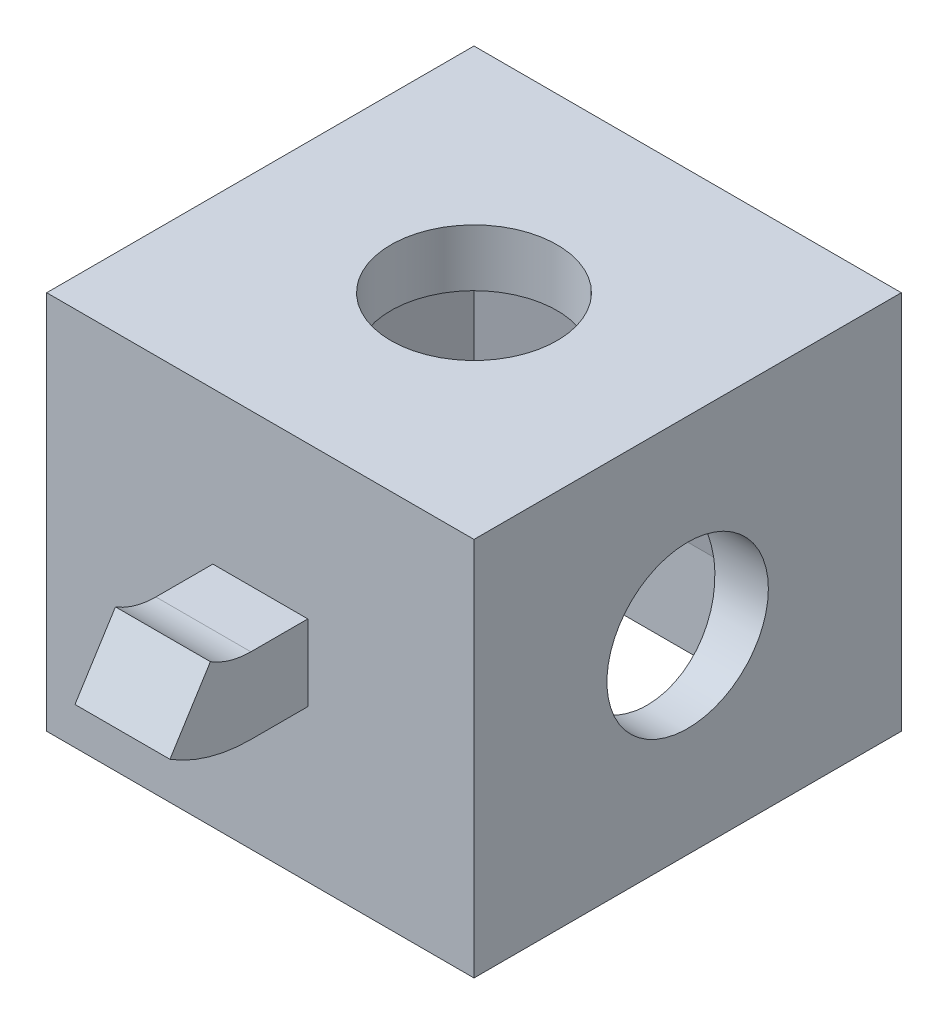
ISO-10303-21;
HEADER;
FILE_DESCRIPTION(('STEP AP214'),'2;1');
FILE_NAME('part.step','',(''),(''),'','','');
FILE_SCHEMA(('AUTOMOTIVE_DESIGN { 1 0 10303 214 1 1 1 1 }'));
ENDSEC;
DATA;
#1=APPLICATION_CONTEXT('core data for automotive mechanical design processes');
#2=APPLICATION_PROTOCOL_DEFINITION('international standard','automotive_design',2000,#1);
#3=PRODUCT_CONTEXT('',#1,'mechanical');
#4=PRODUCT('Part','Part','',(#3));
#5=PRODUCT_RELATED_PRODUCT_CATEGORY('part','',(#4));
#6=PRODUCT_DEFINITION_FORMATION('','',#4);
#7=PRODUCT_DEFINITION_CONTEXT('part definition',#1,'design');
#8=PRODUCT_DEFINITION('design','',#6,#7);
#9=PRODUCT_DEFINITION_SHAPE('','',#8);
#10=(LENGTH_UNIT() NAMED_UNIT(*) SI_UNIT(.MILLI.,.METRE.));
#11=(NAMED_UNIT(*) PLANE_ANGLE_UNIT() SI_UNIT($,.RADIAN.));
#12=(NAMED_UNIT(*) SI_UNIT($,.STERADIAN.) SOLID_ANGLE_UNIT());
#13=UNCERTAINTY_MEASURE_WITH_UNIT(LENGTH_MEASURE(1.E-05),#10,'distance_accuracy_value','');
#14=(GEOMETRIC_REPRESENTATION_CONTEXT(3) GLOBAL_UNCERTAINTY_ASSIGNED_CONTEXT((#13)) GLOBAL_UNIT_ASSIGNED_CONTEXT((#10,
#11,#12)) REPRESENTATION_CONTEXT('',''));
#15=CARTESIAN_POINT('',(0.,0.,0.));
#16=DIRECTION('',(0.,0.,1.));
#17=DIRECTION('',(1.,0.,0.));
#18=AXIS2_PLACEMENT_3D('',#15,#16,#17);
#19=CARTESIAN_POINT('',(11.25,20.,-11.25));
#20=DIRECTION('',(0.,0.,1.));
#21=DIRECTION('',(1.,0.,0.));
#22=AXIS2_PLACEMENT_3D('',#19,#20,#21);
#23=PLANE('',#22);
#24=DIRECTION('',(-1.,0.,0.));
#25=VECTOR('',#24,1.);
#26=CARTESIAN_POINT('',(11.25,0.,-11.25));
#27=LINE('',#26,#25);
#28=CARTESIAN_POINT('',(11.25,0.,-11.25));
#29=VERTEX_POINT('',#28);
#30=CARTESIAN_POINT('',(-11.25,0.,-11.25));
#31=VERTEX_POINT('',#30);
#32=EDGE_CURVE('E360',#29,#31,#27,.T.);
#33=ORIENTED_EDGE('',*,*,#32,.T.);
#34=DIRECTION('',(0.,-1.,0.));
#35=VECTOR('',#34,1.);
#36=CARTESIAN_POINT('',(-11.25,20.,-11.25));
#37=LINE('',#36,#35);
#38=CARTESIAN_POINT('',(-11.25,20.,-11.25));
#39=VERTEX_POINT('',#38);
#40=EDGE_CURVE('E366',#39,#31,#37,.T.);
#41=ORIENTED_EDGE('',*,*,#40,.F.);
#42=DIRECTION('',(-1.,0.,0.));
#43=VECTOR('',#42,1.);
#44=CARTESIAN_POINT('',(11.25,20.,-11.25));
#45=LINE('',#44,#43);
#46=CARTESIAN_POINT('',(11.25,20.,-11.25));
#47=VERTEX_POINT('',#46);
#48=EDGE_CURVE('E364',#47,#39,#45,.T.);
#49=ORIENTED_EDGE('',*,*,#48,.F.);
#50=DIRECTION('',(0.,-1.,0.));
#51=VECTOR('',#50,1.);
#52=CARTESIAN_POINT('',(11.25,20.,-11.25));
#53=LINE('',#52,#51);
#54=EDGE_CURVE('E376',#47,#29,#53,.T.);
#55=ORIENTED_EDGE('',*,*,#54,.T.);
#56=EDGE_LOOP('',(#33,#41,#49,#55));
#57=FACE_BOUND('',#56,.T.);
#58=DIRECTION('',(0.,-1.,0.));
#59=VECTOR('',#58,1.);
#60=CARTESIAN_POINT('',(2.5,12.,-11.25));
#61=LINE('',#60,#59);
#62=CARTESIAN_POINT('',(2.5,12.,-11.25));
#63=VERTEX_POINT('',#62);
#64=CARTESIAN_POINT('',(2.5,8.,-11.25));
#65=VERTEX_POINT('',#64);
#66=EDGE_CURVE('E194',#63,#65,#61,.T.);
#67=ORIENTED_EDGE('',*,*,#66,.F.);
#68=DIRECTION('',(1.,0.,0.));
#69=VECTOR('',#68,1.);
#70=CARTESIAN_POINT('',(-2.5,12.,-11.25));
#71=LINE('',#70,#69);
#72=CARTESIAN_POINT('',(-2.5,12.,-11.25));
#73=VERTEX_POINT('',#72);
#74=EDGE_CURVE('E243',#73,#63,#71,.T.);
#75=ORIENTED_EDGE('',*,*,#74,.F.);
#76=DIRECTION('',(0.,1.,0.));
#77=VECTOR('',#76,1.);
#78=CARTESIAN_POINT('',(-2.5,12.,-11.25));
#79=LINE('',#78,#77);
#80=CARTESIAN_POINT('',(-2.5,8.,-11.25));
#81=VERTEX_POINT('',#80);
#82=EDGE_CURVE('E250',#81,#73,#79,.T.);
#83=ORIENTED_EDGE('',*,*,#82,.F.);
#84=DIRECTION('',(-1.,0.,0.));
#85=VECTOR('',#84,1.);
#86=CARTESIAN_POINT('',(-2.5,8.,-11.25));
#87=LINE('',#86,#85);
#88=EDGE_CURVE('E56',#65,#81,#87,.T.);
#89=ORIENTED_EDGE('',*,*,#88,.F.);
#90=EDGE_LOOP('',(#67,#75,#83,#89));
#91=FACE_BOUND('',#90,.T.);
#92=ADVANCED_FACE('F33',(#57,#91),#23,.F.);
#93=CARTESIAN_POINT('',(0.,0.,0.));
#94=DIRECTION('',(0.,1.,0.));
#95=DIRECTION('',(0.,0.,1.));
#96=AXIS2_PLACEMENT_3D('',#93,#94,#95);
#97=PLANE('',#96);
#98=DIRECTION('',(0.,0.,1.));
#99=VECTOR('',#98,1.);
#100=CARTESIAN_POINT('',(-11.25,0.,11.25));
#101=LINE('',#100,#99);
#102=CARTESIAN_POINT('',(-11.25,0.,11.25));
#103=VERTEX_POINT('',#102);
#104=EDGE_CURVE('E355',#31,#103,#101,.T.);
#105=ORIENTED_EDGE('',*,*,#104,.F.);
#106=ORIENTED_EDGE('',*,*,#32,.F.);
#107=DIRECTION('',(0.,0.,-1.));
#108=VECTOR('',#107,1.);
#109=CARTESIAN_POINT('',(11.25,0.,11.25));
#110=LINE('',#109,#108);
#111=CARTESIAN_POINT('',(11.25,0.,11.25));
#112=VERTEX_POINT('',#111);
#113=EDGE_CURVE('E371',#112,#29,#110,.T.);
#114=ORIENTED_EDGE('',*,*,#113,.F.);
#115=DIRECTION('',(1.,0.,0.));
#116=VECTOR('',#115,1.);
#117=CARTESIAN_POINT('',(11.25,0.,11.25));
#118=LINE('',#117,#116);
#119=EDGE_CURVE('E369',#103,#112,#118,.T.);
#120=ORIENTED_EDGE('',*,*,#119,.F.);
#121=EDGE_LOOP('',(#105,#106,#114,#120));
#122=FACE_BOUND('',#121,.T.);
#123=DIRECTION('',(0.,0.,1.));
#124=VECTOR('',#123,1.);
#125=CARTESIAN_POINT('',(9.25,0.,-9.25));
#126=LINE('',#125,#124);
#127=CARTESIAN_POINT('',(9.25,0.,-9.25));
#128=VERTEX_POINT('',#127);
#129=CARTESIAN_POINT('',(9.25,0.,9.25));
#130=VERTEX_POINT('',#129);
#131=EDGE_CURVE('E323',#128,#130,#126,.T.);
#132=ORIENTED_EDGE('',*,*,#131,.F.);
#133=DIRECTION('',(1.,0.,0.));
#134=VECTOR('',#133,1.);
#135=CARTESIAN_POINT('',(-9.25,0.,-9.25));
#136=LINE('',#135,#134);
#137=CARTESIAN_POINT('',(-9.25,0.,-9.25));
#138=VERTEX_POINT('',#137);
#139=EDGE_CURVE('E331',#138,#128,#136,.T.);
#140=ORIENTED_EDGE('',*,*,#139,.F.);
#141=DIRECTION('',(0.,0.,-1.));
#142=VECTOR('',#141,1.);
#143=CARTESIAN_POINT('',(-9.25,0.,-9.25));
#144=LINE('',#143,#142);
#145=CARTESIAN_POINT('',(-9.25,0.,9.25));
#146=VERTEX_POINT('',#145);
#147=EDGE_CURVE('E328',#146,#138,#144,.T.);
#148=ORIENTED_EDGE('',*,*,#147,.F.);
#149=DIRECTION('',(-1.,0.,0.));
#150=VECTOR('',#149,1.);
#151=CARTESIAN_POINT('',(-9.25,0.,9.25));
#152=LINE('',#151,#150);
#153=EDGE_CURVE('E325',#130,#146,#152,.T.);
#154=ORIENTED_EDGE('',*,*,#153,.F.);
#155=EDGE_LOOP('',(#132,#140,#148,#154));
#156=FACE_BOUND('',#155,.T.);
#157=ADVANCED_FACE('F389',(#122,#156),#97,.F.);
#158=CARTESIAN_POINT('',(-11.25,20.,11.25));
#159=DIRECTION('',(1.,0.,0.));
#160=DIRECTION('',(0.,0.,-1.));
#161=AXIS2_PLACEMENT_3D('',#158,#159,#160);
#162=PLANE('',#161);
#163=ORIENTED_EDGE('',*,*,#104,.T.);
#164=DIRECTION('',(0.,-1.,0.));
#165=VECTOR('',#164,1.);
#166=CARTESIAN_POINT('',(-11.25,20.,11.25));
#167=LINE('',#166,#165);
#168=CARTESIAN_POINT('',(-11.25,20.,11.25));
#169=VERTEX_POINT('',#168);
#170=EDGE_CURVE('E11',#169,#103,#167,.T.);
#171=ORIENTED_EDGE('',*,*,#170,.F.);
#172=DIRECTION('',(0.,0.,1.));
#173=VECTOR('',#172,1.);
#174=CARTESIAN_POINT('',(-11.25,20.,11.25));
#175=LINE('',#174,#173);
#176=EDGE_CURVE('E356',#39,#169,#175,.T.);
#177=ORIENTED_EDGE('',*,*,#176,.F.);
#178=ORIENTED_EDGE('',*,*,#40,.T.);
#179=EDGE_LOOP('',(#163,#171,#177,#178));
#180=FACE_BOUND('',#179,.T.);
#181=ADVANCED_FACE('F35',(#180),#162,.F.);
#182=CARTESIAN_POINT('',(11.25,20.,11.25));
#183=DIRECTION('',(0.,0.,-1.));
#184=DIRECTION('',(-1.,0.,0.));
#185=AXIS2_PLACEMENT_3D('',#182,#183,#184);
#186=PLANE('',#185);
#187=DIRECTION('',(1.,0.,0.));
#188=VECTOR('',#187,1.);
#189=CARTESIAN_POINT('',(-2.5,12.,11.25));
#190=LINE('',#189,#188);
#191=CARTESIAN_POINT('',(-2.5,12.,11.25));
#192=VERTEX_POINT('',#191);
#193=CARTESIAN_POINT('',(2.5,12.,11.25));
#194=VERTEX_POINT('',#193);
#195=EDGE_CURVE('E219',#192,#194,#190,.T.);
#196=ORIENTED_EDGE('',*,*,#195,.T.);
#197=DIRECTION('',(0.,-1.,0.));
#198=VECTOR('',#197,1.);
#199=CARTESIAN_POINT('',(2.5,12.,11.25));
#200=LINE('',#199,#198);
#201=CARTESIAN_POINT('',(2.5,8.,11.25));
#202=VERTEX_POINT('',#201);
#203=EDGE_CURVE('E201',#194,#202,#200,.T.);
#204=ORIENTED_EDGE('',*,*,#203,.T.);
#205=DIRECTION('',(-1.,0.,0.));
#206=VECTOR('',#205,1.);
#207=CARTESIAN_POINT('',(-2.5,8.,11.25));
#208=LINE('',#207,#206);
#209=CARTESIAN_POINT('',(-2.5,8.,11.25));
#210=VERTEX_POINT('',#209);
#211=EDGE_CURVE('E210',#202,#210,#208,.T.);
#212=ORIENTED_EDGE('',*,*,#211,.T.);
#213=DIRECTION('',(0.,1.,0.));
#214=VECTOR('',#213,1.);
#215=CARTESIAN_POINT('',(-2.5,12.,11.25));
#216=LINE('',#215,#214);
#217=EDGE_CURVE('E48',#210,#192,#216,.T.);
#218=ORIENTED_EDGE('',*,*,#217,.T.);
#219=EDGE_LOOP('',(#196,#204,#212,#218));
#220=FACE_BOUND('',#219,.T.);
#221=ORIENTED_EDGE('',*,*,#119,.T.);
#222=DIRECTION('',(0.,-1.,0.));
#223=VECTOR('',#222,1.);
#224=CARTESIAN_POINT('',(11.25,20.,11.25));
#225=LINE('',#224,#223);
#226=CARTESIAN_POINT('',(11.25,20.,11.25));
#227=VERTEX_POINT('',#226);
#228=EDGE_CURVE('E41',#227,#112,#225,.T.);
#229=ORIENTED_EDGE('',*,*,#228,.F.);
#230=DIRECTION('',(1.,0.,0.));
#231=VECTOR('',#230,1.);
#232=CARTESIAN_POINT('',(11.25,20.,11.25));
#233=LINE('',#232,#231);
#234=EDGE_CURVE('E359',#169,#227,#233,.T.);
#235=ORIENTED_EDGE('',*,*,#234,.F.);
#236=ORIENTED_EDGE('',*,*,#170,.T.);
#237=EDGE_LOOP('',(#221,#229,#235,#236));
#238=FACE_BOUND('',#237,.T.);
#239=ADVANCED_FACE('F399',(#220,#238),#186,.F.);
#240=CARTESIAN_POINT('',(11.25,20.,11.25));
#241=DIRECTION('',(-1.,0.,0.));
#242=DIRECTION('',(0.,0.,1.));
#243=AXIS2_PLACEMENT_3D('',#240,#241,#242);
#244=PLANE('',#243);
#245=CARTESIAN_POINT('',(11.25,10.,0.));
#246=DIRECTION('',(1.,0.,0.));
#247=DIRECTION('',(0.,0.,-1.));
#248=AXIS2_PLACEMENT_3D('',#245,#246,#247);
#249=CIRCLE('',#248,4.25);
#250=CARTESIAN_POINT('',(11.25,10.,-4.25));
#251=VERTEX_POINT('',#250);
#252=EDGE_CURVE('E289',#251,#251,#249,.T.);
#253=ORIENTED_EDGE('',*,*,#252,.F.);
#254=EDGE_LOOP('',(#253));
#255=FACE_BOUND('',#254,.T.);
#256=ORIENTED_EDGE('',*,*,#113,.T.);
#257=ORIENTED_EDGE('',*,*,#54,.F.);
#258=DIRECTION('',(0.,0.,-1.));
#259=VECTOR('',#258,1.);
#260=CARTESIAN_POINT('',(11.25,20.,11.25));
#261=LINE('',#260,#259);
#262=EDGE_CURVE('E362',#227,#47,#261,.T.);
#263=ORIENTED_EDGE('',*,*,#262,.F.);
#264=ORIENTED_EDGE('',*,*,#228,.T.);
#265=EDGE_LOOP('',(#256,#257,#263,#264));
#266=FACE_BOUND('',#265,.T.);
#267=ADVANCED_FACE('F383',(#255,#266),#244,.F.);
#268=CARTESIAN_POINT('',(0.,20.,0.));
#269=DIRECTION('',(0.,1.,0.));
#270=DIRECTION('',(0.,0.,1.));
#271=AXIS2_PLACEMENT_3D('',#268,#269,#270);
#272=PLANE('',#271);
#273=CARTESIAN_POINT('',(0.,20.,0.));
#274=DIRECTION('',(0.,1.,0.));
#275=DIRECTION('',(0.,0.,1.));
#276=AXIS2_PLACEMENT_3D('',#273,#274,#275);
#277=CIRCLE('',#276,4.375);
#278=CARTESIAN_POINT('',(0.,20.,4.375));
#279=VERTEX_POINT('',#278);
#280=EDGE_CURVE('E295',#279,#279,#277,.T.);
#281=ORIENTED_EDGE('',*,*,#280,.F.);
#282=EDGE_LOOP('',(#281));
#283=FACE_BOUND('',#282,.T.);
#284=ORIENTED_EDGE('',*,*,#176,.T.);
#285=ORIENTED_EDGE('',*,*,#234,.T.);
#286=ORIENTED_EDGE('',*,*,#262,.T.);
#287=ORIENTED_EDGE('',*,*,#48,.T.);
#288=EDGE_LOOP('',(#284,#285,#286,#287));
#289=FACE_BOUND('',#288,.T.);
#290=ADVANCED_FACE('F398',(#283,#289),#272,.T.);
#291=CARTESIAN_POINT('',(9.25,0.,-9.25));
#292=DIRECTION('',(-1.,0.,0.));
#293=DIRECTION('',(0.,0.,1.));
#294=AXIS2_PLACEMENT_3D('',#291,#292,#293);
#295=PLANE('',#294);
#296=DIRECTION('',(0.,0.,1.));
#297=VECTOR('',#296,1.);
#298=CARTESIAN_POINT('',(9.25,5.,-9.25));
#299=LINE('',#298,#297);
#300=CARTESIAN_POINT('',(9.25,5.,-9.25));
#301=VERTEX_POINT('',#300);
#302=CARTESIAN_POINT('',(9.25,5.,9.25));
#303=VERTEX_POINT('',#302);
#304=EDGE_CURVE('E304',#301,#303,#299,.T.);
#305=ORIENTED_EDGE('',*,*,#304,.F.);
#306=DIRECTION('',(0.,1.,0.));
#307=VECTOR('',#306,1.);
#308=CARTESIAN_POINT('',(9.25,0.,-9.25));
#309=LINE('',#308,#307);
#310=EDGE_CURVE('E333',#128,#301,#309,.T.);
#311=ORIENTED_EDGE('',*,*,#310,.F.);
#312=ORIENTED_EDGE('',*,*,#131,.T.);
#313=DIRECTION('',(0.,1.,0.));
#314=VECTOR('',#313,1.);
#315=CARTESIAN_POINT('',(9.25,0.,9.25));
#316=LINE('',#315,#314);
#317=EDGE_CURVE('E352',#130,#303,#316,.T.);
#318=ORIENTED_EDGE('',*,*,#317,.T.);
#319=EDGE_LOOP('',(#305,#311,#312,#318));
#320=FACE_BOUND('',#319,.T.);
#321=ADVANCED_FACE('F417',(#320),#295,.T.);
#322=CARTESIAN_POINT('',(-9.25,0.,9.25));
#323=DIRECTION('',(0.,0.,-1.));
#324=DIRECTION('',(-1.,0.,0.));
#325=AXIS2_PLACEMENT_3D('',#322,#323,#324);
#326=PLANE('',#325);
#327=DIRECTION('',(-1.,0.,0.));
#328=VECTOR('',#327,1.);
#329=CARTESIAN_POINT('',(-9.25,5.,9.25));
#330=LINE('',#329,#328);
#331=CARTESIAN_POINT('',(-9.25,5.,9.25));
#332=VERTEX_POINT('',#331);
#333=EDGE_CURVE('E336',#303,#332,#330,.T.);
#334=ORIENTED_EDGE('',*,*,#333,.F.);
#335=ORIENTED_EDGE('',*,*,#317,.F.);
#336=ORIENTED_EDGE('',*,*,#153,.T.);
#337=DIRECTION('',(0.,1.,0.));
#338=VECTOR('',#337,1.);
#339=CARTESIAN_POINT('',(-9.25,0.,9.25));
#340=LINE('',#339,#338);
#341=EDGE_CURVE('E349',#146,#332,#340,.T.);
#342=ORIENTED_EDGE('',*,*,#341,.T.);
#343=EDGE_LOOP('',(#334,#335,#336,#342));
#344=FACE_BOUND('',#343,.T.);
#345=ADVANCED_FACE('F421',(#344),#326,.T.);
#346=CARTESIAN_POINT('',(-9.25,0.,-9.25));
#347=DIRECTION('',(1.,0.,0.));
#348=DIRECTION('',(0.,0.,-1.));
#349=AXIS2_PLACEMENT_3D('',#346,#347,#348);
#350=PLANE('',#349);
#351=DIRECTION('',(0.,0.,-1.));
#352=VECTOR('',#351,1.);
#353=CARTESIAN_POINT('',(-9.25,5.,-9.25));
#354=LINE('',#353,#352);
#355=CARTESIAN_POINT('',(-9.25,5.,-9.25));
#356=VERTEX_POINT('',#355);
#357=EDGE_CURVE('E339',#332,#356,#354,.T.);
#358=ORIENTED_EDGE('',*,*,#357,.F.);
#359=ORIENTED_EDGE('',*,*,#341,.F.);
#360=ORIENTED_EDGE('',*,*,#147,.T.);
#361=DIRECTION('',(0.,1.,0.));
#362=VECTOR('',#361,1.);
#363=CARTESIAN_POINT('',(-9.25,0.,-9.25));
#364=LINE('',#363,#362);
#365=EDGE_CURVE('E346',#138,#356,#364,.T.);
#366=ORIENTED_EDGE('',*,*,#365,.T.);
#367=EDGE_LOOP('',(#358,#359,#360,#366));
#368=FACE_BOUND('',#367,.T.);
#369=ADVANCED_FACE('F425',(#368),#350,.T.);
#370=CARTESIAN_POINT('',(-9.25,0.,-9.25));
#371=DIRECTION('',(0.,0.,1.));
#372=DIRECTION('',(1.,0.,0.));
#373=AXIS2_PLACEMENT_3D('',#370,#371,#372);
#374=PLANE('',#373);
#375=DIRECTION('',(1.,0.,0.));
#376=VECTOR('',#375,1.);
#377=CARTESIAN_POINT('',(-9.25,5.,-9.25));
#378=LINE('',#377,#376);
#379=EDGE_CURVE('E326',#356,#301,#378,.T.);
#380=ORIENTED_EDGE('',*,*,#379,.F.);
#381=ORIENTED_EDGE('',*,*,#365,.F.);
#382=ORIENTED_EDGE('',*,*,#139,.T.);
#383=ORIENTED_EDGE('',*,*,#310,.T.);
#384=EDGE_LOOP('',(#380,#381,#382,#383));
#385=FACE_BOUND('',#384,.T.);
#386=ADVANCED_FACE('F429',(#385),#374,.T.);
#387=CARTESIAN_POINT('',(9.25,5.,-9.25));
#388=DIRECTION('',(0.984807753012208,0.17364817766693,0.));
#389=DIRECTION('',(-0.17364817766693,0.984807753012208,0.));
#390=AXIS2_PLACEMENT_3D('',#387,#388,#389);
#391=PLANE('',#390);
#392=CARTESIAN_POINT('',(8.36836509645767,10.,0.));
#393=DIRECTION('',(0.984807753012208,0.17364817766693,0.));
#394=DIRECTION('',(0.17364817766693,-0.984807753012208,0.));
#395=AXIS2_PLACEMENT_3D('',#392,#393,#394);
#396=ELLIPSE('',#395,4.31556310051442,4.25);
#397=CARTESIAN_POINT('',(9.11775476446864,5.75,0.));
#398=VERTEX_POINT('',#397);
#399=EDGE_CURVE('E292',#398,#398,#396,.F.);
#400=ORIENTED_EDGE('',*,*,#399,.F.);
#401=EDGE_LOOP('',(#400));
#402=FACE_BOUND('',#401,.T.);
#403=ORIENTED_EDGE('',*,*,#304,.T.);
#404=DIRECTION('',(0.171087869746036,-0.970287525247814,0.171087869746036));
#405=VECTOR('',#404,1.);
#406=CARTESIAN_POINT('',(8.70848540527662,8.07108187611232,8.70848540527663));
#407=LINE('',#406,#405);
#408=CARTESIAN_POINT('',(7.13407623149842,17.,7.13407623149842));
#409=VERTEX_POINT('',#408);
#410=EDGE_CURVE('E306',#409,#303,#407,.T.);
#411=ORIENTED_EDGE('',*,*,#410,.F.);
#412=DIRECTION('',(0.,0.,1.));
#413=VECTOR('',#412,1.);
#414=CARTESIAN_POINT('',(7.13407623149842,17.,-9.25));
#415=LINE('',#414,#413);
#416=CARTESIAN_POINT('',(7.13407623149842,17.,-7.13407623149842));
#417=VERTEX_POINT('',#416);
#418=EDGE_CURVE('E301',#417,#409,#415,.T.);
#419=ORIENTED_EDGE('',*,*,#418,.F.);
#420=DIRECTION('',(0.171087869746036,-0.970287525247814,-0.171087869746036));
#421=VECTOR('',#420,1.);
#422=CARTESIAN_POINT('',(8.70848540527662,8.07108187611232,-8.70848540527663));
#423=LINE('',#422,#421);
#424=EDGE_CURVE('E302',#417,#301,#423,.T.);
#425=ORIENTED_EDGE('',*,*,#424,.T.);
#426=EDGE_LOOP('',(#403,#411,#419,#425));
#427=FACE_BOUND('',#426,.T.);
#428=ADVANCED_FACE('F433',(#402,#427),#391,.F.);
#429=CARTESIAN_POINT('',(-9.25,5.,-9.25));
#430=DIRECTION('',(0.,0.17364817766693,-0.984807753012208));
#431=DIRECTION('',(0.,0.984807753012208,0.17364817766693));
#432=AXIS2_PLACEMENT_3D('',#429,#430,#431);
#433=PLANE('',#432);
#434=ORIENTED_EDGE('',*,*,#379,.T.);
#435=ORIENTED_EDGE('',*,*,#424,.F.);
#436=DIRECTION('',(1.,0.,0.));
#437=VECTOR('',#436,1.);
#438=CARTESIAN_POINT('',(-9.25,17.,-7.13407623149842));
#439=LINE('',#438,#437);
#440=CARTESIAN_POINT('',(-7.13407623149842,17.,-7.13407623149842));
#441=VERTEX_POINT('',#440);
#442=EDGE_CURVE('E309',#441,#417,#439,.T.);
#443=ORIENTED_EDGE('',*,*,#442,.F.);
#444=DIRECTION('',(-0.171087869746036,-0.970287525247814,-0.171087869746036));
#445=VECTOR('',#444,1.);
#446=CARTESIAN_POINT('',(-9.25,5.,-9.25));
#447=LINE('',#446,#445);
#448=EDGE_CURVE('E305',#441,#356,#447,.T.);
#449=ORIENTED_EDGE('',*,*,#448,.T.);
#450=EDGE_LOOP('',(#434,#435,#443,#449));
#451=FACE_BOUND('',#450,.T.);
#452=ADVANCED_FACE('F435',(#451),#433,.F.);
#453=CARTESIAN_POINT('',(-9.25,5.,-9.25));
#454=DIRECTION('',(-0.984807753012208,0.17364817766693,0.));
#455=DIRECTION('',(-0.17364817766693,-0.984807753012208,0.));
#456=AXIS2_PLACEMENT_3D('',#453,#454,#455);
#457=PLANE('',#456);
#458=ORIENTED_EDGE('',*,*,#357,.T.);
#459=ORIENTED_EDGE('',*,*,#448,.F.);
#460=DIRECTION('',(0.,0.,-1.));
#461=VECTOR('',#460,1.);
#462=CARTESIAN_POINT('',(-7.13407623149842,17.,-9.25));
#463=LINE('',#462,#461);
#464=CARTESIAN_POINT('',(-7.13407623149842,17.,7.13407623149842));
#465=VERTEX_POINT('',#464);
#466=EDGE_CURVE('E318',#465,#441,#463,.T.);
#467=ORIENTED_EDGE('',*,*,#466,.F.);
#468=DIRECTION('',(-0.171087869746036,-0.970287525247814,0.171087869746036));
#469=VECTOR('',#468,1.);
#470=CARTESIAN_POINT('',(-9.25,5.,9.25));
#471=LINE('',#470,#469);
#472=EDGE_CURVE('E308',#465,#332,#471,.T.);
#473=ORIENTED_EDGE('',*,*,#472,.T.);
#474=EDGE_LOOP('',(#458,#459,#467,#473));
#475=FACE_BOUND('',#474,.T.);
#476=ADVANCED_FACE('F438',(#475),#457,.F.);
#477=CARTESIAN_POINT('',(-9.25,5.,9.25));
#478=DIRECTION('',(0.,0.17364817766693,0.984807753012208));
#479=DIRECTION('',(0.,-0.984807753012208,0.17364817766693));
#480=AXIS2_PLACEMENT_3D('',#477,#478,#479);
#481=PLANE('',#480);
#482=ORIENTED_EDGE('',*,*,#333,.T.);
#483=ORIENTED_EDGE('',*,*,#472,.F.);
#484=DIRECTION('',(-1.,0.,0.));
#485=VECTOR('',#484,1.);
#486=CARTESIAN_POINT('',(-9.25,17.,7.13407623149842));
#487=LINE('',#486,#485);
#488=EDGE_CURVE('E315',#409,#465,#487,.T.);
#489=ORIENTED_EDGE('',*,*,#488,.F.);
#490=ORIENTED_EDGE('',*,*,#410,.T.);
#491=EDGE_LOOP('',(#482,#483,#489,#490));
#492=FACE_BOUND('',#491,.T.);
#493=ADVANCED_FACE('F442',(#492),#481,.F.);
#494=CARTESIAN_POINT('',(0.,17.,0.));
#495=DIRECTION('',(0.,1.,0.));
#496=DIRECTION('',(0.,0.,1.));
#497=AXIS2_PLACEMENT_3D('',#494,#495,#496);
#498=PLANE('',#497);
#499=CARTESIAN_POINT('',(0.,17.,0.));
#500=DIRECTION('',(0.,1.,0.));
#501=DIRECTION('',(0.,0.,1.));
#502=AXIS2_PLACEMENT_3D('',#499,#500,#501);
#503=CIRCLE('',#502,4.375);
#504=CARTESIAN_POINT('',(0.,17.,4.375));
#505=VERTEX_POINT('',#504);
#506=EDGE_CURVE('E298',#505,#505,#503,.F.);
#507=ORIENTED_EDGE('',*,*,#506,.F.);
#508=EDGE_LOOP('',(#507));
#509=FACE_BOUND('',#508,.T.);
#510=ORIENTED_EDGE('',*,*,#418,.T.);
#511=ORIENTED_EDGE('',*,*,#488,.T.);
#512=ORIENTED_EDGE('',*,*,#466,.T.);
#513=ORIENTED_EDGE('',*,*,#442,.T.);
#514=EDGE_LOOP('',(#510,#511,#512,#513));
#515=FACE_BOUND('',#514,.T.);
#516=ADVANCED_FACE('F446',(#509,#515),#498,.F.);
#517=CARTESIAN_POINT('',(0.,-0.001000000000001,0.));
#518=DIRECTION('',(0.,1.,0.));
#519=DIRECTION('',(0.,0.,1.));
#520=AXIS2_PLACEMENT_3D('',#517,#518,#519);
#521=CYLINDRICAL_SURFACE('',#520,4.375);
#522=ORIENTED_EDGE('',*,*,#280,.T.);
#523=EDGE_LOOP('',(#522));
#524=FACE_BOUND('',#523,.T.);
#525=ORIENTED_EDGE('',*,*,#506,.T.);
#526=EDGE_LOOP('',(#525));
#527=FACE_BOUND('',#526,.T.);
#528=ADVANCED_FACE('F453',(#524,#527),#521,.F.);
#529=CARTESIAN_POINT('',(-11.251,10.,0.));
#530=DIRECTION('',(1.,0.,0.));
#531=DIRECTION('',(0.,0.,-1.));
#532=AXIS2_PLACEMENT_3D('',#529,#530,#531);
#533=CYLINDRICAL_SURFACE('',#532,4.25);
#534=ORIENTED_EDGE('',*,*,#252,.T.);
#535=EDGE_LOOP('',(#534));
#536=FACE_BOUND('',#535,.T.);
#537=ORIENTED_EDGE('',*,*,#399,.T.);
#538=EDGE_LOOP('',(#537));
#539=FACE_BOUND('',#538,.T.);
#540=ADVANCED_FACE('F457',(#536,#539),#533,.F.);
#541=CARTESIAN_POINT('',(0.,16.,-14.25));
#542=DIRECTION('',(1.,0.,0.));
#543=DIRECTION('',(0.,0.,-1.));
#544=AXIS2_PLACEMENT_3D('',#541,#542,#543);
#545=CYLINDRICAL_SURFACE('',#544,8.);
#546=DIRECTION('',(-1.,0.,0.));
#547=VECTOR('',#546,1.);
#548=CARTESIAN_POINT('',(-2.5,8.,-14.25));
#549=LINE('',#548,#547);
#550=CARTESIAN_POINT('',(2.5,8.,-14.25));
#551=VERTEX_POINT('',#550);
#552=CARTESIAN_POINT('',(-2.5,8.,-14.25));
#553=VERTEX_POINT('',#552);
#554=EDGE_CURVE('E239',#551,#553,#549,.T.);
#555=ORIENTED_EDGE('',*,*,#554,.T.);
#556=CARTESIAN_POINT('',(-2.5,16.,-14.25));
#557=DIRECTION('',(1.,0.,0.));
#558=DIRECTION('',(0.,0.,-1.));
#559=AXIS2_PLACEMENT_3D('',#556,#557,#558);
#560=CIRCLE('',#559,8.);
#561=CARTESIAN_POINT('',(-2.5,9.22890341459289,-18.5105458606953));
#562=VERTEX_POINT('',#561);
#563=EDGE_CURVE('E283',#553,#562,#560,.T.);
#564=ORIENTED_EDGE('',*,*,#563,.T.);
#565=DIRECTION('',(-1.,0.,0.));
#566=VECTOR('',#565,1.);
#567=CARTESIAN_POINT('',(-2.5,9.22890341459289,-18.5105458606953));
#568=LINE('',#567,#566);
#569=CARTESIAN_POINT('',(2.5,9.22890341459289,-18.5105458606953));
#570=VERTEX_POINT('',#569);
#571=EDGE_CURVE('E274',#570,#562,#568,.T.);
#572=ORIENTED_EDGE('',*,*,#571,.F.);
#573=CARTESIAN_POINT('',(2.5,16.,-14.25));
#574=DIRECTION('',(1.,0.,0.));
#575=DIRECTION('',(0.,0.,-1.));
#576=AXIS2_PLACEMENT_3D('',#573,#574,#575);
#577=CIRCLE('',#576,8.);
#578=EDGE_CURVE('E286',#551,#570,#577,.T.);
#579=ORIENTED_EDGE('',*,*,#578,.F.);
#580=EDGE_LOOP('',(#555,#564,#572,#579));
#581=FACE_BOUND('',#580,.T.);
#582=ADVANCED_FACE('F461',(#581),#545,.T.);
#583=CARTESIAN_POINT('',(0.,16.,-14.25));
#584=DIRECTION('',(1.,0.,0.));
#585=DIRECTION('',(0.,0.,-1.));
#586=AXIS2_PLACEMENT_3D('',#583,#584,#585);
#587=CYLINDRICAL_SURFACE('',#586,4.);
#588=DIRECTION('',(1.,0.,0.));
#589=VECTOR('',#588,1.);
#590=CARTESIAN_POINT('',(-2.5,12.,-14.25));
#591=LINE('',#590,#589);
#592=CARTESIAN_POINT('',(-2.5,12.,-14.25));
#593=VERTEX_POINT('',#592);
#594=CARTESIAN_POINT('',(2.5,12.,-14.25));
#595=VERTEX_POINT('',#594);
#596=EDGE_CURVE('E242',#593,#595,#591,.T.);
#597=ORIENTED_EDGE('',*,*,#596,.T.);
#598=CARTESIAN_POINT('',(2.5,16.,-14.25));
#599=DIRECTION('',(1.,0.,0.));
#600=DIRECTION('',(0.,0.,-1.));
#601=AXIS2_PLACEMENT_3D('',#598,#599,#600);
#602=CIRCLE('',#601,4.);
#603=CARTESIAN_POINT('',(2.5,12.6144517072964,-16.3802729303477));
#604=VERTEX_POINT('',#603);
#605=EDGE_CURVE('E277',#595,#604,#602,.T.);
#606=ORIENTED_EDGE('',*,*,#605,.T.);
#607=DIRECTION('',(1.,0.,0.));
#608=VECTOR('',#607,1.);
#609=CARTESIAN_POINT('',(-2.5,12.6144517072964,-16.3802729303477));
#610=LINE('',#609,#608);
#611=CARTESIAN_POINT('',(-2.5,12.6144517072964,-16.3802729303477));
#612=VERTEX_POINT('',#611);
#613=EDGE_CURVE('E268',#612,#604,#610,.T.);
#614=ORIENTED_EDGE('',*,*,#613,.F.);
#615=CARTESIAN_POINT('',(-2.5,16.,-14.25));
#616=DIRECTION('',(1.,0.,0.));
#617=DIRECTION('',(0.,0.,-1.));
#618=AXIS2_PLACEMENT_3D('',#615,#616,#617);
#619=CIRCLE('',#618,4.);
#620=EDGE_CURVE('E280',#593,#612,#619,.T.);
#621=ORIENTED_EDGE('',*,*,#620,.F.);
#622=EDGE_LOOP('',(#597,#606,#614,#621));
#623=FACE_BOUND('',#622,.T.);
#624=ADVANCED_FACE('F465',(#623),#587,.F.);
#625=CARTESIAN_POINT('',(2.5,12.,-14.25));
#626=DIRECTION('',(-1.,0.,0.));
#627=DIRECTION('',(0.,-1.,0.));
#628=AXIS2_PLACEMENT_3D('',#625,#626,#627);
#629=PLANE('',#628);
#630=ORIENTED_EDGE('',*,*,#66,.T.);
#631=DIRECTION('',(0.,0.,1.));
#632=VECTOR('',#631,1.);
#633=CARTESIAN_POINT('',(2.5,8.,-14.25));
#634=LINE('',#633,#632);
#635=EDGE_CURVE('E263',#551,#65,#634,.T.);
#636=ORIENTED_EDGE('',*,*,#635,.F.);
#637=ORIENTED_EDGE('',*,*,#578,.T.);
#638=DIRECTION('',(0.,-0.846387073175888,-0.532568232586918));
#639=VECTOR('',#638,1.);
#640=CARTESIAN_POINT('',(2.5,12.6144517072964,-16.3802729303477));
#641=LINE('',#640,#639);
#642=EDGE_CURVE('E265',#604,#570,#641,.T.);
#643=ORIENTED_EDGE('',*,*,#642,.F.);
#644=ORIENTED_EDGE('',*,*,#605,.F.);
#645=DIRECTION('',(0.,0.,1.));
#646=VECTOR('',#645,1.);
#647=CARTESIAN_POINT('',(2.5,12.,-14.25));
#648=LINE('',#647,#646);
#649=EDGE_CURVE('E246',#595,#63,#648,.T.);
#650=ORIENTED_EDGE('',*,*,#649,.T.);
#651=EDGE_LOOP('',(#630,#636,#637,#643,#644,#650));
#652=FACE_BOUND('',#651,.T.);
#653=ADVANCED_FACE('F469',(#652),#629,.F.);
#654=CARTESIAN_POINT('',(-2.5,8.,-14.25));
#655=DIRECTION('',(0.,1.,0.));
#656=DIRECTION('',(0.,0.,1.));
#657=AXIS2_PLACEMENT_3D('',#654,#655,#656);
#658=PLANE('',#657);
#659=ORIENTED_EDGE('',*,*,#88,.T.);
#660=DIRECTION('',(0.,0.,1.));
#661=VECTOR('',#660,1.);
#662=CARTESIAN_POINT('',(-2.5,8.,-14.25));
#663=LINE('',#662,#661);
#664=EDGE_CURVE('E260',#553,#81,#663,.T.);
#665=ORIENTED_EDGE('',*,*,#664,.F.);
#666=ORIENTED_EDGE('',*,*,#554,.F.);
#667=ORIENTED_EDGE('',*,*,#635,.T.);
#668=EDGE_LOOP('',(#659,#665,#666,#667));
#669=FACE_BOUND('',#668,.T.);
#670=ADVANCED_FACE('F473',(#669),#658,.F.);
#671=CARTESIAN_POINT('',(-2.5,12.,-14.25));
#672=DIRECTION('',(1.,0.,0.));
#673=DIRECTION('',(0.,1.,0.));
#674=AXIS2_PLACEMENT_3D('',#671,#672,#673);
#675=PLANE('',#674);
#676=ORIENTED_EDGE('',*,*,#82,.T.);
#677=DIRECTION('',(0.,0.,1.));
#678=VECTOR('',#677,1.);
#679=CARTESIAN_POINT('',(-2.5,12.,-14.25));
#680=LINE('',#679,#678);
#681=EDGE_CURVE('E257',#593,#73,#680,.T.);
#682=ORIENTED_EDGE('',*,*,#681,.F.);
#683=ORIENTED_EDGE('',*,*,#620,.T.);
#684=DIRECTION('',(0.,0.846387073175888,0.532568232586918));
#685=VECTOR('',#684,1.);
#686=CARTESIAN_POINT('',(-2.5,12.6144517072964,-16.3802729303477));
#687=LINE('',#686,#685);
#688=EDGE_CURVE('E271',#562,#612,#687,.T.);
#689=ORIENTED_EDGE('',*,*,#688,.F.);
#690=ORIENTED_EDGE('',*,*,#563,.F.);
#691=ORIENTED_EDGE('',*,*,#664,.T.);
#692=EDGE_LOOP('',(#676,#682,#683,#689,#690,#691));
#693=FACE_BOUND('',#692,.T.);
#694=ADVANCED_FACE('F477',(#693),#675,.F.);
#695=CARTESIAN_POINT('',(-2.5,12.,-14.25));
#696=DIRECTION('',(0.,-1.,0.));
#697=DIRECTION('',(0.,0.,-1.));
#698=AXIS2_PLACEMENT_3D('',#695,#696,#697);
#699=PLANE('',#698);
#700=ORIENTED_EDGE('',*,*,#74,.T.);
#701=ORIENTED_EDGE('',*,*,#649,.F.);
#702=ORIENTED_EDGE('',*,*,#596,.F.);
#703=ORIENTED_EDGE('',*,*,#681,.T.);
#704=EDGE_LOOP('',(#700,#701,#702,#703));
#705=FACE_BOUND('',#704,.T.);
#706=ADVANCED_FACE('F481',(#705),#699,.F.);
#707=CARTESIAN_POINT('',(0.,2.45780682918579,-22.7710917213907));
#708=DIRECTION('',(0.,-0.532568232586918,0.846387073175888));
#709=DIRECTION('',(1.,0.,0.));
#710=AXIS2_PLACEMENT_3D('',#707,#708,#709);
#711=PLANE('',#710);
#712=ORIENTED_EDGE('',*,*,#642,.T.);
#713=ORIENTED_EDGE('',*,*,#571,.T.);
#714=ORIENTED_EDGE('',*,*,#688,.T.);
#715=ORIENTED_EDGE('',*,*,#613,.T.);
#716=EDGE_LOOP('',(#712,#713,#714,#715));
#717=FACE_BOUND('',#716,.T.);
#718=ADVANCED_FACE('F485',(#717),#711,.F.);
#719=CARTESIAN_POINT('',(0.,16.,14.25));
#720=DIRECTION('',(-1.,0.,0.));
#721=DIRECTION('',(0.,0.,1.));
#722=AXIS2_PLACEMENT_3D('',#719,#720,#721);
#723=CYLINDRICAL_SURFACE('',#722,4.);
#724=DIRECTION('',(1.,0.,0.));
#725=VECTOR('',#724,1.);
#726=CARTESIAN_POINT('',(-2.5,12.,14.25));
#727=LINE('',#726,#725);
#728=CARTESIAN_POINT('',(-2.5,12.,14.25));
#729=VERTEX_POINT('',#728);
#730=CARTESIAN_POINT('',(2.5,12.,14.25));
#731=VERTEX_POINT('',#730);
#732=EDGE_CURVE('E188',#729,#731,#727,.T.);
#733=ORIENTED_EDGE('',*,*,#732,.F.);
#734=CARTESIAN_POINT('',(-2.5,16.,14.25));
#735=DIRECTION('',(-1.,0.,0.));
#736=DIRECTION('',(0.,0.,1.));
#737=AXIS2_PLACEMENT_3D('',#734,#735,#736);
#738=CIRCLE('',#737,4.);
#739=CARTESIAN_POINT('',(-2.5,12.6144517072964,16.3802729303477));
#740=VERTEX_POINT('',#739);
#741=EDGE_CURVE('E195',#729,#740,#738,.T.);
#742=ORIENTED_EDGE('',*,*,#741,.T.);
#743=DIRECTION('',(1.,0.,0.));
#744=VECTOR('',#743,1.);
#745=CARTESIAN_POINT('',(-2.5,12.6144517072964,16.3802729303477));
#746=LINE('',#745,#744);
#747=CARTESIAN_POINT('',(2.5,12.6144517072964,16.3802729303477));
#748=VERTEX_POINT('',#747);
#749=EDGE_CURVE('E191',#740,#748,#746,.T.);
#750=ORIENTED_EDGE('',*,*,#749,.T.);
#751=CARTESIAN_POINT('',(2.5,16.,14.25));
#752=DIRECTION('',(-1.,0.,0.));
#753=DIRECTION('',(0.,0.,1.));
#754=AXIS2_PLACEMENT_3D('',#751,#752,#753);
#755=CIRCLE('',#754,4.);
#756=EDGE_CURVE('E183',#731,#748,#755,.T.);
#757=ORIENTED_EDGE('',*,*,#756,.F.);
#758=EDGE_LOOP('',(#733,#742,#750,#757));
#759=FACE_BOUND('',#758,.T.);
#760=ADVANCED_FACE('F185',(#759),#723,.F.);
#761=CARTESIAN_POINT('',(0.,16.,14.25));
#762=DIRECTION('',(-1.,0.,0.));
#763=DIRECTION('',(0.,0.,1.));
#764=AXIS2_PLACEMENT_3D('',#761,#762,#763);
#765=CYLINDRICAL_SURFACE('',#764,8.);
#766=DIRECTION('',(-1.,0.,0.));
#767=VECTOR('',#766,1.);
#768=CARTESIAN_POINT('',(-2.5,8.,14.25));
#769=LINE('',#768,#767);
#770=CARTESIAN_POINT('',(2.5,8.,14.25));
#771=VERTEX_POINT('',#770);
#772=CARTESIAN_POINT('',(-2.5,8.,14.25));
#773=VERTEX_POINT('',#772);
#774=EDGE_CURVE('E209',#771,#773,#769,.T.);
#775=ORIENTED_EDGE('',*,*,#774,.F.);
#776=CARTESIAN_POINT('',(2.5,16.,14.25));
#777=DIRECTION('',(-1.,0.,0.));
#778=DIRECTION('',(0.,0.,1.));
#779=AXIS2_PLACEMENT_3D('',#776,#777,#778);
#780=CIRCLE('',#779,8.);
#781=CARTESIAN_POINT('',(2.5,9.22890341459289,18.5105458606953));
#782=VERTEX_POINT('',#781);
#783=EDGE_CURVE('E232',#771,#782,#780,.T.);
#784=ORIENTED_EDGE('',*,*,#783,.T.);
#785=DIRECTION('',(-1.,0.,0.));
#786=VECTOR('',#785,1.);
#787=CARTESIAN_POINT('',(-2.5,9.22890341459289,18.5105458606953));
#788=LINE('',#787,#786);
#789=CARTESIAN_POINT('',(-2.5,9.22890341459289,18.5105458606953));
#790=VERTEX_POINT('',#789);
#791=EDGE_CURVE('E227',#782,#790,#788,.T.);
#792=ORIENTED_EDGE('',*,*,#791,.T.);
#793=CARTESIAN_POINT('',(-2.5,16.,14.25));
#794=DIRECTION('',(-1.,0.,0.));
#795=DIRECTION('',(0.,0.,1.));
#796=AXIS2_PLACEMENT_3D('',#793,#794,#795);
#797=CIRCLE('',#796,8.);
#798=EDGE_CURVE('E235',#773,#790,#797,.T.);
#799=ORIENTED_EDGE('',*,*,#798,.F.);
#800=EDGE_LOOP('',(#775,#784,#792,#799));
#801=FACE_BOUND('',#800,.T.);
#802=ADVANCED_FACE('F492',(#801),#765,.T.);
#803=CARTESIAN_POINT('',(2.5,12.,14.25));
#804=DIRECTION('',(1.,0.,0.));
#805=DIRECTION('',(0.,1.,0.));
#806=AXIS2_PLACEMENT_3D('',#803,#804,#805);
#807=PLANE('',#806);
#808=ORIENTED_EDGE('',*,*,#203,.F.);
#809=DIRECTION('',(0.,0.,-1.));
#810=VECTOR('',#809,1.);
#811=CARTESIAN_POINT('',(2.5,12.,14.25));
#812=LINE('',#811,#810);
#813=EDGE_CURVE('E198',#731,#194,#812,.T.);
#814=ORIENTED_EDGE('',*,*,#813,.F.);
#815=ORIENTED_EDGE('',*,*,#756,.T.);
#816=DIRECTION('',(0.,-0.846387073175888,0.532568232586918));
#817=VECTOR('',#816,1.);
#818=CARTESIAN_POINT('',(2.5,12.6144517072964,16.3802729303477));
#819=LINE('',#818,#817);
#820=EDGE_CURVE('E205',#748,#782,#819,.T.);
#821=ORIENTED_EDGE('',*,*,#820,.T.);
#822=ORIENTED_EDGE('',*,*,#783,.F.);
#823=DIRECTION('',(0.,0.,-1.));
#824=VECTOR('',#823,1.);
#825=CARTESIAN_POINT('',(2.5,8.,14.25));
#826=LINE('',#825,#824);
#827=EDGE_CURVE('E213',#771,#202,#826,.T.);
#828=ORIENTED_EDGE('',*,*,#827,.T.);
#829=EDGE_LOOP('',(#808,#814,#815,#821,#822,#828));
#830=FACE_BOUND('',#829,.T.);
#831=ADVANCED_FACE('F199',(#830),#807,.T.);
#832=CARTESIAN_POINT('',(-2.5,12.,14.25));
#833=DIRECTION('',(0.,1.,0.));
#834=DIRECTION('',(0.,0.,1.));
#835=AXIS2_PLACEMENT_3D('',#832,#833,#834);
#836=PLANE('',#835);
#837=ORIENTED_EDGE('',*,*,#195,.F.);
#838=DIRECTION('',(0.,0.,-1.));
#839=VECTOR('',#838,1.);
#840=CARTESIAN_POINT('',(-2.5,12.,14.25));
#841=LINE('',#840,#839);
#842=EDGE_CURVE('E206',#729,#192,#841,.T.);
#843=ORIENTED_EDGE('',*,*,#842,.F.);
#844=ORIENTED_EDGE('',*,*,#732,.T.);
#845=ORIENTED_EDGE('',*,*,#813,.T.);
#846=EDGE_LOOP('',(#837,#843,#844,#845));
#847=FACE_BOUND('',#846,.T.);
#848=ADVANCED_FACE('F208',(#847),#836,.T.);
#849=CARTESIAN_POINT('',(-2.5,12.,14.25));
#850=DIRECTION('',(-1.,0.,0.));
#851=DIRECTION('',(0.,-1.,0.));
#852=AXIS2_PLACEMENT_3D('',#849,#850,#851);
#853=PLANE('',#852);
#854=ORIENTED_EDGE('',*,*,#217,.F.);
#855=DIRECTION('',(0.,0.,-1.));
#856=VECTOR('',#855,1.);
#857=CARTESIAN_POINT('',(-2.5,8.,14.25));
#858=LINE('',#857,#856);
#859=EDGE_CURVE('E223',#773,#210,#858,.T.);
#860=ORIENTED_EDGE('',*,*,#859,.F.);
#861=ORIENTED_EDGE('',*,*,#798,.T.);
#862=DIRECTION('',(0.,0.846387073175888,-0.532568232586918));
#863=VECTOR('',#862,1.);
#864=CARTESIAN_POINT('',(-2.5,12.6144517072964,16.3802729303477));
#865=LINE('',#864,#863);
#866=EDGE_CURVE('E229',#790,#740,#865,.T.);
#867=ORIENTED_EDGE('',*,*,#866,.T.);
#868=ORIENTED_EDGE('',*,*,#741,.F.);
#869=ORIENTED_EDGE('',*,*,#842,.T.);
#870=EDGE_LOOP('',(#854,#860,#861,#867,#868,#869));
#871=FACE_BOUND('',#870,.T.);
#872=ADVANCED_FACE('F500',(#871),#853,.T.);
#873=CARTESIAN_POINT('',(-2.5,8.,14.25));
#874=DIRECTION('',(0.,-1.,0.));
#875=DIRECTION('',(0.,0.,-1.));
#876=AXIS2_PLACEMENT_3D('',#873,#874,#875);
#877=PLANE('',#876);
#878=ORIENTED_EDGE('',*,*,#211,.F.);
#879=ORIENTED_EDGE('',*,*,#827,.F.);
#880=ORIENTED_EDGE('',*,*,#774,.T.);
#881=ORIENTED_EDGE('',*,*,#859,.T.);
#882=EDGE_LOOP('',(#878,#879,#880,#881));
#883=FACE_BOUND('',#882,.T.);
#884=ADVANCED_FACE('F503',(#883),#877,.T.);
#885=CARTESIAN_POINT('',(0.,2.45780682918579,22.7710917213907));
#886=DIRECTION('',(0.,-0.532568232586918,-0.846387073175888));
#887=DIRECTION('',(1.,0.,0.));
#888=AXIS2_PLACEMENT_3D('',#885,#886,#887);
#889=PLANE('',#888);
#890=ORIENTED_EDGE('',*,*,#820,.F.);
#891=ORIENTED_EDGE('',*,*,#749,.F.);
#892=ORIENTED_EDGE('',*,*,#866,.F.);
#893=ORIENTED_EDGE('',*,*,#791,.F.);
#894=EDGE_LOOP('',(#890,#891,#892,#893));
#895=FACE_BOUND('',#894,.T.);
#896=ADVANCED_FACE('F506',(#895),#889,.F.);
#897=CLOSED_SHELL('',(#92,#157,#181,#239,#267,#290,#321,#345,#369,#386,#428,#452,#476,#493,#516,
#528,#540,#582,#624,#653,#670,#694,#706,#718,#760,#802,#831,#848,#872,#884,#896));
#898=MANIFOLD_SOLID_BREP('B2',#897);
#899=ADVANCED_BREP_SHAPE_REPRESENTATION('',(#18,#898),#14);
#900=SHAPE_DEFINITION_REPRESENTATION(#9,#899);
ENDSEC;
END-ISO-10303-21;
